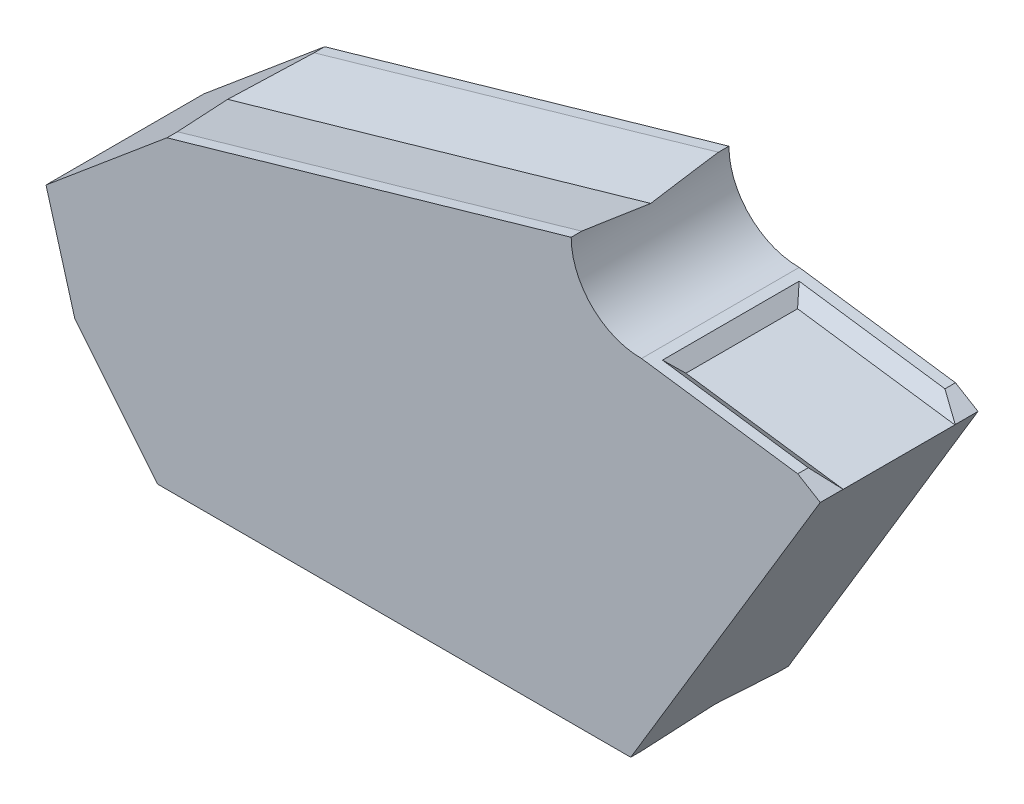
ISO-10303-21;
HEADER;
FILE_DESCRIPTION(('STEP AP214'),'2;1');
FILE_NAME('part.step','',(''),(''),'','','');
FILE_SCHEMA(('AUTOMOTIVE_DESIGN { 1 0 10303 214 1 1 1 1 }'));
ENDSEC;
DATA;
#1=APPLICATION_CONTEXT('core data for automotive mechanical design processes');
#2=APPLICATION_PROTOCOL_DEFINITION('international standard','automotive_design',2000,#1);
#3=PRODUCT_CONTEXT('',#1,'mechanical');
#4=PRODUCT('Part','Part','',(#3));
#5=PRODUCT_RELATED_PRODUCT_CATEGORY('part','',(#4));
#6=PRODUCT_DEFINITION_FORMATION('','',#4);
#7=PRODUCT_DEFINITION_CONTEXT('part definition',#1,'design');
#8=PRODUCT_DEFINITION('design','',#6,#7);
#9=PRODUCT_DEFINITION_SHAPE('','',#8);
#10=(LENGTH_UNIT() NAMED_UNIT(*) SI_UNIT(.MILLI.,.METRE.));
#11=(NAMED_UNIT(*) PLANE_ANGLE_UNIT() SI_UNIT($,.RADIAN.));
#12=(NAMED_UNIT(*) SI_UNIT($,.STERADIAN.) SOLID_ANGLE_UNIT());
#13=UNCERTAINTY_MEASURE_WITH_UNIT(LENGTH_MEASURE(1.E-05),#10,'distance_accuracy_value','');
#14=(GEOMETRIC_REPRESENTATION_CONTEXT(3) GLOBAL_UNCERTAINTY_ASSIGNED_CONTEXT((#13)) GLOBAL_UNIT_ASSIGNED_CONTEXT((#10,
#11,#12)) REPRESENTATION_CONTEXT('',''));
#15=CARTESIAN_POINT('',(0.,0.,0.));
#16=DIRECTION('',(0.,0.,1.));
#17=DIRECTION('',(1.,0.,0.));
#18=AXIS2_PLACEMENT_3D('',#15,#16,#17);
#19=CARTESIAN_POINT('',(0.,0.,3.));
#20=DIRECTION('',(0.,1.,0.));
#21=DIRECTION('',(0.,0.,1.));
#22=AXIS2_PLACEMENT_3D('',#19,#20,#21);
#23=PLANE('',#22);
#24=DIRECTION('',(0.,0.,-1.));
#25=VECTOR('',#24,1.);
#26=CARTESIAN_POINT('',(9.,0.,3.));
#27=LINE('',#26,#25);
#28=CARTESIAN_POINT('',(9.,0.,0.199999999999999));
#29=VERTEX_POINT('',#28);
#30=CARTESIAN_POINT('',(9.,0.,0.));
#31=VERTEX_POINT('',#30);
#32=EDGE_CURVE('E187',#29,#31,#27,.T.);
#33=ORIENTED_EDGE('',*,*,#32,.F.);
#34=DIRECTION('',(1.,0.,0.));
#35=VECTOR('',#34,1.);
#36=CARTESIAN_POINT('',(13.7314236186779,0.,0.2));
#37=LINE('',#36,#35);
#38=CARTESIAN_POINT('',(0.,0.,0.199999999999998));
#39=VERTEX_POINT('',#38);
#40=EDGE_CURVE('E181',#39,#29,#37,.T.);
#41=ORIENTED_EDGE('',*,*,#40,.F.);
#42=DIRECTION('',(0.,0.,-1.));
#43=VECTOR('',#42,1.);
#44=CARTESIAN_POINT('',(0.,0.,3.));
#45=LINE('',#44,#43);
#46=CARTESIAN_POINT('',(0.,0.,0.));
#47=VERTEX_POINT('',#46);
#48=EDGE_CURVE('E186',#39,#47,#45,.T.);
#49=ORIENTED_EDGE('',*,*,#48,.T.);
#50=DIRECTION('',(1.,0.,0.));
#51=VECTOR('',#50,1.);
#52=CARTESIAN_POINT('',(0.,0.,0.));
#53=LINE('',#52,#51);
#54=EDGE_CURVE('E288',#47,#31,#53,.T.);
#55=ORIENTED_EDGE('',*,*,#54,.T.);
#56=EDGE_LOOP('',(#33,#41,#49,#55));
#57=FACE_BOUND('',#56,.T.);
#58=ADVANCED_FACE('F31',(#57),#23,.F.);
#59=CARTESIAN_POINT('',(7.86830957964082,8.,3.));
#60=DIRECTION('',(0.275856954738902,-0.961198699812988,0.));
#61=DIRECTION('',(0.961198699812989,0.275856954738902,0.));
#62=AXIS2_PLACEMENT_3D('',#59,#60,#61);
#63=PLANE('',#62);
#64=DIRECTION('',(0.,0.,-1.));
#65=VECTOR('',#64,1.);
#66=CARTESIAN_POINT('',(7.86830957964082,8.,3.));
#67=LINE('',#66,#65);
#68=CARTESIAN_POINT('',(7.86830957964082,8.,3.));
#69=VERTEX_POINT('',#68);
#70=CARTESIAN_POINT('',(7.86830957964082,8.,2.8));
#71=VERTEX_POINT('',#70);
#72=EDGE_CURVE('E223',#69,#71,#67,.T.);
#73=ORIENTED_EDGE('',*,*,#72,.T.);
#74=DIRECTION('',(0.961198699812988,0.275856954738902,0.));
#75=VECTOR('',#74,1.);
#76=CARTESIAN_POINT('',(-3.4128844141553,4.76238032619805,2.8));
#77=LINE('',#76,#75);
#78=CARTESIAN_POINT('',(0.178719981136918,5.79314436208879,2.8));
#79=VERTEX_POINT('',#78);
#80=EDGE_CURVE('E214',#79,#71,#77,.T.);
#81=ORIENTED_EDGE('',*,*,#80,.F.);
#82=DIRECTION('',(0.,0.,-1.));
#83=VECTOR('',#82,1.);
#84=CARTESIAN_POINT('',(0.178719981136915,5.79314436208878,3.));
#85=LINE('',#84,#83);
#86=CARTESIAN_POINT('',(0.178719981136915,5.79314436208878,3.));
#87=VERTEX_POINT('',#86);
#88=EDGE_CURVE('E209',#87,#79,#85,.T.);
#89=ORIENTED_EDGE('',*,*,#88,.F.);
#90=DIRECTION('',(-0.961198699812989,-0.275856954738902,0.));
#91=VECTOR('',#90,1.);
#92=CARTESIAN_POINT('',(7.86830957964082,8.,3.));
#93=LINE('',#92,#91);
#94=EDGE_CURVE('E279',#69,#87,#93,.T.);
#95=ORIENTED_EDGE('',*,*,#94,.F.);
#96=EDGE_LOOP('',(#73,#81,#89,#95));
#97=FACE_BOUND('',#96,.T.);
#98=ADVANCED_FACE('F220',(#97),#63,.F.);
#99=CARTESIAN_POINT('',(12.605551275464,6.,3.));
#100=DIRECTION('',(-0.515078753637713,-0.857142857142857,0.));
#101=DIRECTION('',(0.857142857142857,-0.515078753637713,0.));
#102=AXIS2_PLACEMENT_3D('',#99,#100,#101);
#103=PLANE('',#102);
#104=DIRECTION('',(0.,0.,-1.));
#105=VECTOR('',#104,1.);
#106=CARTESIAN_POINT('',(12.1769798468926,6.25753937681886,3.));
#107=LINE('',#106,#105);
#108=CARTESIAN_POINT('',(12.1769798468926,6.25753937681886,0.2));
#109=VERTEX_POINT('',#108);
#110=CARTESIAN_POINT('',(12.1769798468926,6.25753937681886,0.));
#111=VERTEX_POINT('',#110);
#112=EDGE_CURVE('E319',#109,#111,#107,.T.);
#113=ORIENTED_EDGE('',*,*,#112,.F.);
#114=DIRECTION('',(0.776613506286922,-0.466686636355895,0.42317259516603));
#115=VECTOR('',#114,1.);
#116=CARTESIAN_POINT('',(13.4490011755885,5.49314968946937,0.893117699361664));
#117=LINE('',#116,#115);
#118=CARTESIAN_POINT('',(12.605551275464,6.,0.433526306424525));
#119=VERTEX_POINT('',#118);
#120=EDGE_CURVE('E259',#109,#119,#117,.T.);
#121=ORIENTED_EDGE('',*,*,#120,.T.);
#122=DIRECTION('',(0.,0.,-1.));
#123=VECTOR('',#122,1.);
#124=CARTESIAN_POINT('',(12.605551275464,6.,3.));
#125=LINE('',#124,#123);
#126=CARTESIAN_POINT('',(12.605551275464,6.,0.));
#127=VERTEX_POINT('',#126);
#128=EDGE_CURVE('E322',#119,#127,#125,.T.);
#129=ORIENTED_EDGE('',*,*,#128,.T.);
#130=DIRECTION('',(-0.857142857142857,0.515078753637713,0.));
#131=VECTOR('',#130,1.);
#132=CARTESIAN_POINT('',(12.605551275464,6.,0.));
#133=LINE('',#132,#131);
#134=EDGE_CURVE('E294',#127,#111,#133,.T.);
#135=ORIENTED_EDGE('',*,*,#134,.T.);
#136=EDGE_LOOP('',(#113,#121,#129,#135));
#137=FACE_BOUND('',#136,.T.);
#138=ADVANCED_FACE('F334',(#137),#103,.F.);
#139=CARTESIAN_POINT('',(-1.57391937320297,1.94236397378462,3.));
#140=DIRECTION('',(0.776945589513848,0.629567749281187,0.));
#141=DIRECTION('',(-0.629567749281187,0.776945589513848,0.));
#142=AXIS2_PLACEMENT_3D('',#139,#140,#141);
#143=PLANE('',#142);
#144=ORIENTED_EDGE('',*,*,#48,.F.);
#145=DIRECTION('',(-0.11206317795339,0.138296461273947,0.984030453261529));
#146=VECTOR('',#145,1.);
#147=CARTESIAN_POINT('',(-0.358634190385133,0.442588192909718,3.34917862731458));
#148=LINE('',#147,#146);
#149=CARTESIAN_POINT('',(-0.148046364679617,0.182703085113107,1.5));
#150=VERTEX_POINT('',#149);
#151=EDGE_CURVE('E227',#39,#150,#148,.T.);
#152=ORIENTED_EDGE('',*,*,#151,.T.);
#153=DIRECTION('',(0.11206317795339,-0.138296461273947,0.984030453261529));
#154=VECTOR('',#153,1.);
#155=CARTESIAN_POINT('',(-0.0278134509989285,0.0343244044941158,2.5557691715237));
#156=LINE('',#155,#154);
#157=CARTESIAN_POINT('',(0.,0.,2.8));
#158=VERTEX_POINT('',#157);
#159=EDGE_CURVE('E402',#150,#158,#156,.T.);
#160=ORIENTED_EDGE('',*,*,#159,.T.);
#161=CARTESIAN_POINT('',(0.,0.,3.));
#162=VERTEX_POINT('',#161);
#163=EDGE_CURVE('E180',#162,#158,#45,.T.);
#164=ORIENTED_EDGE('',*,*,#163,.F.);
#165=DIRECTION('',(0.629567749281187,-0.776945589513848,0.));
#166=VECTOR('',#165,1.);
#167=CARTESIAN_POINT('',(-1.57391937320297,1.94236397378462,3.));
#168=LINE('',#167,#166);
#169=CARTESIAN_POINT('',(-1.57391937320297,1.94236397378462,3.));
#170=VERTEX_POINT('',#169);
#171=EDGE_CURVE('E266',#170,#162,#168,.T.);
#172=ORIENTED_EDGE('',*,*,#171,.F.);
#173=DIRECTION('',(0.,0.,-1.));
#174=VECTOR('',#173,1.);
#175=CARTESIAN_POINT('',(-1.57391937320297,1.94236397378462,3.));
#176=LINE('',#175,#174);
#177=CARTESIAN_POINT('',(-1.57391937320297,1.94236397378462,0.));
#178=VERTEX_POINT('',#177);
#179=EDGE_CURVE('E285',#170,#178,#176,.T.);
#180=ORIENTED_EDGE('',*,*,#179,.T.);
#181=DIRECTION('',(0.629567749281187,-0.776945589513848,0.));
#182=VECTOR('',#181,1.);
#183=CARTESIAN_POINT('',(-1.57391937320297,1.94236397378462,0.));
#184=LINE('',#183,#182);
#185=EDGE_CURVE('E265',#178,#47,#184,.T.);
#186=ORIENTED_EDGE('',*,*,#185,.T.);
#187=EDGE_LOOP('',(#144,#152,#160,#164,#172,#180,#186));
#188=FACE_BOUND('',#187,.T.);
#189=ADVANCED_FACE('F33',(#188),#143,.F.);
#190=ORIENTED_EDGE('',*,*,#163,.T.);
#191=DIRECTION('',(-1.,0.,0.));
#192=VECTOR('',#191,1.);
#193=CARTESIAN_POINT('',(13.7314236186779,0.,2.8));
#194=LINE('',#193,#192);
#195=CARTESIAN_POINT('',(9.,0.,2.8));
#196=VERTEX_POINT('',#195);
#197=EDGE_CURVE('E168',#196,#158,#194,.T.);
#198=ORIENTED_EDGE('',*,*,#197,.F.);
#199=CARTESIAN_POINT('',(9.,0.,3.));
#200=VERTEX_POINT('',#199);
#201=EDGE_CURVE('E177',#200,#196,#27,.T.);
#202=ORIENTED_EDGE('',*,*,#201,.F.);
#203=DIRECTION('',(1.,0.,0.));
#204=VECTOR('',#203,1.);
#205=CARTESIAN_POINT('',(0.,0.,3.));
#206=LINE('',#205,#204);
#207=EDGE_CURVE('E269',#162,#200,#206,.T.);
#208=ORIENTED_EDGE('',*,*,#207,.F.);
#209=EDGE_LOOP('',(#190,#198,#202,#208));
#210=FACE_BOUND('',#209,.T.);
#211=ADVANCED_FACE('F176',(#210),#23,.F.);
#212=CARTESIAN_POINT('',(9.,0.,3.));
#213=DIRECTION('',(-0.857142857142857,0.515078753637712,0.));
#214=DIRECTION('',(-0.515078753637712,-0.857142857142857,0.));
#215=AXIS2_PLACEMENT_3D('',#212,#213,#214);
#216=PLANE('',#215);
#217=DIRECTION('',(0.0833416700029704,0.138688922113158,-0.986822957234076));
#218=VECTOR('',#217,1.);
#219=CARTESIAN_POINT('',(8.98355130534937,-0.0273722824510627,2.99476390978484));
#220=LINE('',#219,#218);
#221=CARTESIAN_POINT('',(9.10979089026013,0.182703085113108,1.5));
#222=VERTEX_POINT('',#221);
#223=EDGE_CURVE('E39',#196,#222,#220,.T.);
#224=ORIENTED_EDGE('',*,*,#223,.T.);
#225=DIRECTION('',(-0.0833416700029704,-0.138688922113158,-0.986822957234076));
#226=VECTOR('',#225,1.);
#227=CARTESIAN_POINT('',(9.23028172510884,0.383211954314876,2.92669473698778));
#228=LINE('',#227,#226);
#229=EDGE_CURVE('E11',#222,#29,#228,.T.);
#230=ORIENTED_EDGE('',*,*,#229,.T.);
#231=ORIENTED_EDGE('',*,*,#32,.T.);
#232=DIRECTION('',(0.515078753637712,0.857142857142857,0.));
#233=VECTOR('',#232,1.);
#234=CARTESIAN_POINT('',(9.,0.,0.));
#235=LINE('',#234,#233);
#236=EDGE_CURVE('E291',#31,#127,#235,.T.);
#237=ORIENTED_EDGE('',*,*,#236,.T.);
#238=ORIENTED_EDGE('',*,*,#128,.F.);
#239=DIRECTION('',(-0.347097370021527,-0.577604937780607,0.738847718799754));
#240=VECTOR('',#239,1.);
#241=CARTESIAN_POINT('',(10.3100782760546,2.18010203039364,5.31977764585383));
#242=LINE('',#241,#240);
#243=CARTESIAN_POINT('',(12.6032848534297,5.99622844575863,0.438350718518842));
#244=VERTEX_POINT('',#243);
#245=EDGE_CURVE('E262',#119,#244,#242,.T.);
#246=ORIENTED_EDGE('',*,*,#245,.T.);
#247=DIRECTION('',(0.,0.,1.));
#248=VECTOR('',#247,1.);
#249=CARTESIAN_POINT('',(12.6032848534297,5.99622844575863,3.));
#250=LINE('',#249,#248);
#251=CARTESIAN_POINT('',(12.6032848534297,5.99622844575863,2.56164928148116));
#252=VERTEX_POINT('',#251);
#253=EDGE_CURVE('E197',#244,#252,#250,.T.);
#254=ORIENTED_EDGE('',*,*,#253,.T.);
#255=DIRECTION('',(0.347097370021527,0.577604937780607,0.738847718799754));
#256=VECTOR('',#255,1.);
#257=CARTESIAN_POINT('',(11.07943457618,3.46038830233366,-0.682089791127033));
#258=LINE('',#257,#256);
#259=CARTESIAN_POINT('',(12.605551275464,6.,2.56647369357547));
#260=VERTEX_POINT('',#259);
#261=EDGE_CURVE('E256',#252,#260,#258,.T.);
#262=ORIENTED_EDGE('',*,*,#261,.T.);
#263=CARTESIAN_POINT('',(12.605551275464,6.,3.));
#264=VERTEX_POINT('',#263);
#265=EDGE_CURVE('E190',#264,#260,#125,.T.);
#266=ORIENTED_EDGE('',*,*,#265,.F.);
#267=DIRECTION('',(0.515078753637712,0.857142857142857,0.));
#268=VECTOR('',#267,1.);
#269=CARTESIAN_POINT('',(9.,0.,3.));
#270=LINE('',#269,#268);
#271=EDGE_CURVE('E185',#200,#264,#270,.T.);
#272=ORIENTED_EDGE('',*,*,#271,.F.);
#273=ORIENTED_EDGE('',*,*,#201,.T.);
#274=EDGE_LOOP('',(#224,#230,#231,#237,#238,#246,#254,#262,#266,#272,#273));
#275=FACE_BOUND('',#274,.T.);
#276=ADVANCED_FACE('F183',(#275),#216,.F.);
#277=ORIENTED_EDGE('',*,*,#265,.T.);
#278=DIRECTION('',(-0.776613506286922,0.466686636355895,0.42317259516603));
#279=VECTOR('',#278,1.);
#280=CARTESIAN_POINT('',(12.4630765168992,6.08561667457746,2.64410743653699));
#281=LINE('',#280,#279);
#282=CARTESIAN_POINT('',(12.1769798468926,6.25753937681886,2.8));
#283=VERTEX_POINT('',#282);
#284=EDGE_CURVE('E243',#260,#283,#281,.T.);
#285=ORIENTED_EDGE('',*,*,#284,.T.);
#286=CARTESIAN_POINT('',(12.1769798468926,6.25753937681886,3.));
#287=VERTEX_POINT('',#286);
#288=EDGE_CURVE('E320',#287,#283,#107,.T.);
#289=ORIENTED_EDGE('',*,*,#288,.F.);
#290=DIRECTION('',(-0.857142857142857,0.515078753637713,0.));
#291=VECTOR('',#290,1.);
#292=CARTESIAN_POINT('',(12.605551275464,6.,3.));
#293=LINE('',#292,#291);
#294=EDGE_CURVE('E273',#264,#287,#293,.T.);
#295=ORIENTED_EDGE('',*,*,#294,.F.);
#296=EDGE_LOOP('',(#277,#285,#289,#295));
#297=FACE_BOUND('',#296,.T.);
#298=ADVANCED_FACE('F352',(#297),#103,.F.);
#299=CARTESIAN_POINT('',(12.1769798468926,6.25753937681886,3.));
#300=DIRECTION('',(-0.137958239333101,-0.990438046623872,0.));
#301=DIRECTION('',(0.990438046623872,-0.137958239333101,0.));
#302=AXIS2_PLACEMENT_3D('',#299,#300,#301);
#303=PLANE('',#302);
#304=DIRECTION('',(0.,0.,1.));
#305=VECTOR('',#304,1.);
#306=CARTESIAN_POINT('',(9.40375331634572,6.64382244695154,0.2));
#307=LINE('',#306,#305);
#308=CARTESIAN_POINT('',(9.40375331634572,6.64382244695154,0.2));
#309=VERTEX_POINT('',#308);
#310=CARTESIAN_POINT('',(9.40375331634572,6.64382244695154,2.8));
#311=VERTEX_POINT('',#310);
#312=EDGE_CURVE('E235',#309,#311,#307,.T.);
#313=ORIENTED_EDGE('',*,*,#312,.F.);
#314=DIRECTION('',(0.990438046623872,-0.137958239333101,0.));
#315=VECTOR('',#314,1.);
#316=CARTESIAN_POINT('',(12.1769798468926,6.25753937681886,0.200000000000001));
#317=LINE('',#316,#315);
#318=EDGE_CURVE('E194',#309,#109,#317,.T.);
#319=ORIENTED_EDGE('',*,*,#318,.T.);
#320=ORIENTED_EDGE('',*,*,#112,.T.);
#321=DIRECTION('',(-0.990438046623872,0.137958239333101,0.));
#322=VECTOR('',#321,1.);
#323=CARTESIAN_POINT('',(12.1769798468926,6.25753937681886,0.));
#324=LINE('',#323,#322);
#325=CARTESIAN_POINT('',(9.20566570702094,6.67141409481816,0.));
#326=VERTEX_POINT('',#325);
#327=EDGE_CURVE('E297',#111,#326,#324,.T.);
#328=ORIENTED_EDGE('',*,*,#327,.T.);
#329=DIRECTION('',(0.,0.,-1.));
#330=VECTOR('',#329,1.);
#331=CARTESIAN_POINT('',(9.20566570702094,6.67141409481816,3.));
#332=LINE('',#331,#330);
#333=CARTESIAN_POINT('',(9.20566570702094,6.67141409481816,3.));
#334=VERTEX_POINT('',#333);
#335=EDGE_CURVE('E317',#334,#326,#332,.T.);
#336=ORIENTED_EDGE('',*,*,#335,.F.);
#337=DIRECTION('',(-0.990438046623872,0.137958239333101,0.));
#338=VECTOR('',#337,1.);
#339=CARTESIAN_POINT('',(12.1769798468926,6.25753937681886,3.));
#340=LINE('',#339,#338);
#341=EDGE_CURVE('E275',#287,#334,#340,.T.);
#342=ORIENTED_EDGE('',*,*,#341,.F.);
#343=ORIENTED_EDGE('',*,*,#288,.T.);
#344=DIRECTION('',(0.990438046623872,-0.137958239333101,0.));
#345=VECTOR('',#344,1.);
#346=CARTESIAN_POINT('',(13.720529677425,6.04253812795828,2.8));
#347=LINE('',#346,#345);
#348=EDGE_CURVE('E237',#311,#283,#347,.T.);
#349=ORIENTED_EDGE('',*,*,#348,.F.);
#350=EDGE_LOOP('',(#313,#319,#320,#328,#336,#342,#343,#349));
#351=FACE_BOUND('',#350,.T.);
#352=ADVANCED_FACE('F329',(#351),#303,.F.);
#353=CARTESIAN_POINT('',(9.19692424185896,8.,3.));
#354=DIRECTION('',(0.,0.,-1.));
#355=DIRECTION('',(-1.,0.,0.));
#356=AXIS2_PLACEMENT_3D('',#353,#354,#355);
#357=CYLINDRICAL_SURFACE('',#356,1.32861466221814);
#358=CARTESIAN_POINT('',(9.19692424185896,8.,2.80783704264364));
#359=DIRECTION('',(0.273172333818223,-0.951844380140717,-0.139173100960065));
#360=DIRECTION('',(-0.0383918678124133,0.133773003691756,-0.99026806874157));
#361=AXIS2_PLACEMENT_3D('',#358,#359,#360);
#362=ELLIPSE('',#361,9.54649032789304,1.32861466221814);
#363=CARTESIAN_POINT('',(7.86830957964082,8.,0.2));
#364=VERTEX_POINT('',#363);
#365=CARTESIAN_POINT('',(7.88143755309194,7.8136892586623,1.5));
#366=VERTEX_POINT('',#365);
#367=EDGE_CURVE('E225',#364,#366,#362,.F.);
#368=ORIENTED_EDGE('',*,*,#367,.T.);
#369=CARTESIAN_POINT('',(9.19692424185896,8.,0.192162957356357));
#370=DIRECTION('',(0.273172333818223,-0.951844380140717,0.139173100960065));
#371=DIRECTION('',(0.0383918678124133,-0.133773003691756,-0.99026806874157));
#372=AXIS2_PLACEMENT_3D('',#369,#370,#371);
#373=ELLIPSE('',#372,9.54649032789304,1.32861466221814);
#374=EDGE_CURVE('E233',#366,#71,#373,.F.);
#375=ORIENTED_EDGE('',*,*,#374,.T.);
#376=ORIENTED_EDGE('',*,*,#72,.F.);
#377=CARTESIAN_POINT('',(9.19692424185896,8.,3.));
#378=DIRECTION('',(0.,0.,-1.));
#379=DIRECTION('',(1.,0.,0.));
#380=AXIS2_PLACEMENT_3D('',#377,#378,#379);
#381=CIRCLE('',#380,1.32861466221814);
#382=EDGE_CURVE('E277',#334,#69,#381,.T.);
#383=ORIENTED_EDGE('',*,*,#382,.F.);
#384=ORIENTED_EDGE('',*,*,#335,.T.);
#385=CARTESIAN_POINT('',(9.19692424185896,8.,0.));
#386=DIRECTION('',(0.,0.,-1.));
#387=DIRECTION('',(1.,0.,0.));
#388=AXIS2_PLACEMENT_3D('',#385,#386,#387);
#389=CIRCLE('',#388,1.32861466221814);
#390=CARTESIAN_POINT('',(7.86830957964082,8.,0.));
#391=VERTEX_POINT('',#390);
#392=EDGE_CURVE('E299',#326,#391,#389,.T.);
#393=ORIENTED_EDGE('',*,*,#392,.T.);
#394=EDGE_CURVE('E315',#364,#391,#67,.T.);
#395=ORIENTED_EDGE('',*,*,#394,.F.);
#396=EDGE_LOOP('',(#368,#375,#376,#383,#384,#393,#395));
#397=FACE_BOUND('',#396,.T.);
#398=ADVANCED_FACE('F345',(#397),#357,.F.);
#399=CARTESIAN_POINT('',(0.178719981136915,5.79314436208878,0.2));
#400=VERTEX_POINT('',#399);
#401=CARTESIAN_POINT('',(0.178719981136915,5.79314436208878,0.));
#402=VERTEX_POINT('',#401);
#403=EDGE_CURVE('E313',#400,#402,#85,.T.);
#404=ORIENTED_EDGE('',*,*,#403,.F.);
#405=DIRECTION('',(-0.961198699812988,-0.275856954738902,0.));
#406=VECTOR('',#405,1.);
#407=CARTESIAN_POINT('',(-3.4128844141553,4.76238032619805,0.2));
#408=LINE('',#407,#406);
#409=EDGE_CURVE('E54',#364,#400,#408,.T.);
#410=ORIENTED_EDGE('',*,*,#409,.F.);
#411=ORIENTED_EDGE('',*,*,#394,.T.);
#412=DIRECTION('',(-0.961198699812989,-0.275856954738902,0.));
#413=VECTOR('',#412,1.);
#414=CARTESIAN_POINT('',(7.86830957964082,8.,0.));
#415=LINE('',#414,#413);
#416=EDGE_CURVE('E302',#391,#402,#415,.T.);
#417=ORIENTED_EDGE('',*,*,#416,.T.);
#418=EDGE_LOOP('',(#404,#410,#411,#417));
#419=FACE_BOUND('',#418,.T.);
#420=ADVANCED_FACE('F381',(#419),#63,.F.);
#421=CARTESIAN_POINT('',(0.178719981136915,5.79314436208878,3.));
#422=DIRECTION('',(0.64231533775632,-0.766440478369315,0.));
#423=DIRECTION('',(0.766440478369316,0.64231533775632,0.));
#424=AXIS2_PLACEMENT_3D('',#421,#422,#423);
#425=PLANE('',#424);
#426=ORIENTED_EDGE('',*,*,#88,.T.);
#427=DIRECTION('',(-0.250734007877706,-0.210127600905965,-0.944975580970792));
#428=VECTOR('',#427,1.);
#429=CARTESIAN_POINT('',(0.226107484089591,5.83285745243761,2.97859576972622));
#430=LINE('',#429,#428);
#431=CARTESIAN_POINT('',(-0.166214022243528,5.5040724678742,1.5));
#432=VERTEX_POINT('',#431);
#433=EDGE_CURVE('E172',#79,#432,#430,.T.);
#434=ORIENTED_EDGE('',*,*,#433,.T.);
#435=DIRECTION('',(0.250734007877706,0.210127600905965,-0.944975580970792));
#436=VECTOR('',#435,1.);
#437=CARTESIAN_POINT('',(-0.484705060200519,5.23716109720527,2.70034077616704));
#438=LINE('',#437,#436);
#439=EDGE_CURVE('E200',#432,#400,#438,.T.);
#440=ORIENTED_EDGE('',*,*,#439,.T.);
#441=ORIENTED_EDGE('',*,*,#403,.T.);
#442=DIRECTION('',(-0.766440478369315,-0.64231533775632,0.));
#443=VECTOR('',#442,1.);
#444=CARTESIAN_POINT('',(0.178719981136915,5.79314436208878,0.));
#445=LINE('',#444,#443);
#446=CARTESIAN_POINT('',(-2.12060145397103,3.86619834881983,0.));
#447=VERTEX_POINT('',#446);
#448=EDGE_CURVE('E305',#402,#447,#445,.T.);
#449=ORIENTED_EDGE('',*,*,#448,.T.);
#450=DIRECTION('',(0.,0.,-1.));
#451=VECTOR('',#450,1.);
#452=CARTESIAN_POINT('',(-2.12060145397103,3.86619834881983,3.));
#453=LINE('',#452,#451);
#454=CARTESIAN_POINT('',(-2.12060145397103,3.86619834881983,3.));
#455=VERTEX_POINT('',#454);
#456=EDGE_CURVE('E310',#455,#447,#453,.T.);
#457=ORIENTED_EDGE('',*,*,#456,.F.);
#458=DIRECTION('',(-0.766440478369315,-0.64231533775632,0.));
#459=VECTOR('',#458,1.);
#460=CARTESIAN_POINT('',(0.178719981136915,5.79314436208878,3.));
#461=LINE('',#460,#459);
#462=EDGE_CURVE('E281',#87,#455,#461,.T.);
#463=ORIENTED_EDGE('',*,*,#462,.F.);
#464=EDGE_LOOP('',(#426,#434,#440,#441,#449,#457,#463));
#465=FACE_BOUND('',#464,.T.);
#466=ADVANCED_FACE('F205',(#465),#425,.F.);
#467=CARTESIAN_POINT('',(-2.12060145397103,3.86619834881983,3.));
#468=DIRECTION('',(0.961917187517603,0.273341040384031,0.));
#469=DIRECTION('',(-0.273341040384031,0.961917187517603,0.));
#470=AXIS2_PLACEMENT_3D('',#467,#468,#469);
#471=PLANE('',#470);
#472=DIRECTION('',(0.273341040384031,-0.961917187517603,0.));
#473=VECTOR('',#472,1.);
#474=CARTESIAN_POINT('',(-2.12060145397103,3.86619834881983,0.));
#475=LINE('',#474,#473);
#476=EDGE_CURVE('E270',#447,#178,#475,.T.);
#477=ORIENTED_EDGE('',*,*,#476,.T.);
#478=ORIENTED_EDGE('',*,*,#179,.F.);
#479=DIRECTION('',(0.273341040384031,-0.961917187517603,0.));
#480=VECTOR('',#479,1.);
#481=CARTESIAN_POINT('',(-2.12060145397103,3.86619834881983,3.));
#482=LINE('',#481,#480);
#483=EDGE_CURVE('E283',#455,#170,#482,.T.);
#484=ORIENTED_EDGE('',*,*,#483,.F.);
#485=ORIENTED_EDGE('',*,*,#456,.T.);
#486=EDGE_LOOP('',(#477,#478,#484,#485));
#487=FACE_BOUND('',#486,.T.);
#488=ADVANCED_FACE('F410',(#487),#471,.F.);
#489=CARTESIAN_POINT('',(9.19692424185896,8.,3.));
#490=DIRECTION('',(0.,0.,1.));
#491=DIRECTION('',(1.,0.,0.));
#492=AXIS2_PLACEMENT_3D('',#489,#490,#491);
#493=PLANE('',#492);
#494=ORIENTED_EDGE('',*,*,#171,.T.);
#495=ORIENTED_EDGE('',*,*,#207,.T.);
#496=ORIENTED_EDGE('',*,*,#271,.T.);
#497=ORIENTED_EDGE('',*,*,#294,.T.);
#498=ORIENTED_EDGE('',*,*,#341,.T.);
#499=ORIENTED_EDGE('',*,*,#382,.T.);
#500=ORIENTED_EDGE('',*,*,#94,.T.);
#501=ORIENTED_EDGE('',*,*,#462,.T.);
#502=ORIENTED_EDGE('',*,*,#483,.T.);
#503=EDGE_LOOP('',(#494,#495,#496,#497,#498,#499,#500,#501,#502));
#504=FACE_BOUND('',#503,.T.);
#505=ADVANCED_FACE('F348',(#504),#493,.T.);
#506=CARTESIAN_POINT('',(9.19692424185896,8.,0.));
#507=DIRECTION('',(0.,0.,1.));
#508=DIRECTION('',(1.,0.,0.));
#509=AXIS2_PLACEMENT_3D('',#506,#507,#508);
#510=PLANE('',#509);
#511=ORIENTED_EDGE('',*,*,#185,.F.);
#512=ORIENTED_EDGE('',*,*,#476,.F.);
#513=ORIENTED_EDGE('',*,*,#448,.F.);
#514=ORIENTED_EDGE('',*,*,#416,.F.);
#515=ORIENTED_EDGE('',*,*,#392,.F.);
#516=ORIENTED_EDGE('',*,*,#327,.F.);
#517=ORIENTED_EDGE('',*,*,#134,.F.);
#518=ORIENTED_EDGE('',*,*,#236,.F.);
#519=ORIENTED_EDGE('',*,*,#54,.F.);
#520=EDGE_LOOP('',(#511,#512,#513,#514,#515,#516,#517,#518,#519));
#521=FACE_BOUND('',#520,.T.);
#522=ADVANCED_FACE('F340',(#521),#510,.F.);
#523=CARTESIAN_POINT('',(9.3761616684791,6.44573483762677,2.8));
#524=DIRECTION('',(-0.137958239333101,-0.990438046623872,0.));
#525=DIRECTION('',(0.990438046623872,-0.137958239333101,0.));
#526=AXIS2_PLACEMENT_3D('',#523,#524,#525);
#527=PLANE('',#526);
#528=DIRECTION('',(-0.990438046623872,0.137958239333101,0.));
#529=VECTOR('',#528,1.);
#530=CARTESIAN_POINT('',(13.6929380295584,5.84445051863351,0.438350718518842));
#531=LINE('',#530,#529);
#532=CARTESIAN_POINT('',(9.6122332885403,6.41285239215613,0.438350718518842));
#533=VERTEX_POINT('',#532);
#534=EDGE_CURVE('E247',#244,#533,#531,.T.);
#535=ORIENTED_EDGE('',*,*,#534,.T.);
#536=DIRECTION('',(0.,0.,1.));
#537=VECTOR('',#536,1.);
#538=CARTESIAN_POINT('',(9.6122332885403,6.41285239215613,0.2));
#539=LINE('',#538,#537);
#540=CARTESIAN_POINT('',(9.6122332885403,6.41285239215613,2.56164928148116));
#541=VERTEX_POINT('',#540);
#542=EDGE_CURVE('E239',#533,#541,#539,.T.);
#543=ORIENTED_EDGE('',*,*,#542,.T.);
#544=DIRECTION('',(0.990438046623872,-0.137958239333101,0.));
#545=VECTOR('',#544,1.);
#546=CARTESIAN_POINT('',(13.6929380295584,5.84445051863351,2.56164928148116));
#547=LINE('',#546,#545);
#548=EDGE_CURVE('E250',#541,#252,#547,.T.);
#549=ORIENTED_EDGE('',*,*,#548,.T.);
#550=ORIENTED_EDGE('',*,*,#253,.F.);
#551=EDGE_LOOP('',(#535,#543,#549,#550));
#552=FACE_BOUND('',#551,.T.);
#553=ADVANCED_FACE('F358',(#552),#527,.F.);
#554=CARTESIAN_POINT('',(13.720529677425,6.04253812795828,0.2));
#555=DIRECTION('',(-0.1056821426236,-0.758719561869833,-0.642787609686539));
#556=DIRECTION('',(0.,0.646407516241885,-0.762992347894786));
#557=AXIS2_PLACEMENT_3D('',#554,#555,#556);
#558=PLANE('',#557);
#559=ORIENTED_EDGE('',*,*,#120,.F.);
#560=ORIENTED_EDGE('',*,*,#318,.F.);
#561=DIRECTION('',(-0.531909135300761,0.58928961297028,-0.608120402411343));
#562=VECTOR('',#561,1.);
#563=CARTESIAN_POINT('',(10.8135590036782,5.08193190453457,1.81180086034366));
#564=LINE('',#563,#562);
#565=EDGE_CURVE('E240',#533,#309,#564,.T.);
#566=ORIENTED_EDGE('',*,*,#565,.F.);
#567=ORIENTED_EDGE('',*,*,#534,.F.);
#568=ORIENTED_EDGE('',*,*,#245,.F.);
#569=EDGE_LOOP('',(#559,#560,#566,#567,#568));
#570=FACE_BOUND('',#569,.T.);
#571=ADVANCED_FACE('F361',(#570),#558,.F.);
#572=CARTESIAN_POINT('',(13.720529677425,6.04253812795828,2.8));
#573=DIRECTION('',(-0.1056821426236,-0.758719561869833,0.642787609686539));
#574=DIRECTION('',(0.,-0.646407516241885,-0.762992347894786));
#575=AXIS2_PLACEMENT_3D('',#572,#573,#574);
#576=PLANE('',#575);
#577=ORIENTED_EDGE('',*,*,#548,.F.);
#578=DIRECTION('',(-0.531909135300761,0.58928961297028,0.608120402411343));
#579=VECTOR('',#578,1.);
#580=CARTESIAN_POINT('',(10.2447617895997,5.71208895185313,1.83849289804477));
#581=LINE('',#580,#579);
#582=EDGE_CURVE('E244',#541,#311,#581,.T.);
#583=ORIENTED_EDGE('',*,*,#582,.T.);
#584=ORIENTED_EDGE('',*,*,#348,.T.);
#585=ORIENTED_EDGE('',*,*,#284,.F.);
#586=ORIENTED_EDGE('',*,*,#261,.F.);
#587=EDGE_LOOP('',(#577,#583,#584,#585,#586));
#588=FACE_BOUND('',#587,.T.);
#589=ADVANCED_FACE('F355',(#588),#576,.F.);
#590=CARTESIAN_POINT('',(9.40375331634572,6.64382244695154,0.2));
#591=DIRECTION('',(-0.742323447155564,-0.670041714972345,0.));
#592=DIRECTION('',(0.670041714972345,-0.742323447155564,0.));
#593=AXIS2_PLACEMENT_3D('',#590,#591,#592);
#594=PLANE('',#593);
#595=ORIENTED_EDGE('',*,*,#312,.T.);
#596=ORIENTED_EDGE('',*,*,#582,.F.);
#597=ORIENTED_EDGE('',*,*,#542,.F.);
#598=ORIENTED_EDGE('',*,*,#565,.T.);
#599=EDGE_LOOP('',(#595,#596,#597,#598));
#600=FACE_BOUND('',#599,.T.);
#601=ADVANCED_FACE('F364',(#600),#594,.F.);
#602=CARTESIAN_POINT('',(-3.4128844141553,4.76238032619805,2.8));
#603=DIRECTION('',(0.273172333818223,-0.951844380140717,0.139173100960065));
#604=DIRECTION('',(0.961198699812988,0.275856954738902,0.));
#605=AXIS2_PLACEMENT_3D('',#602,#603,#604);
#606=PLANE('',#605);
#607=DIRECTION('',(0.961198699812988,0.275856954738902,0.));
#608=VECTOR('',#607,1.);
#609=CARTESIAN_POINT('',(-3.36248449747459,4.58676635833551,1.5));
#610=LINE('',#609,#608);
#611=EDGE_CURVE('E217',#432,#366,#610,.T.);
#612=ORIENTED_EDGE('',*,*,#611,.F.);
#613=ORIENTED_EDGE('',*,*,#433,.F.);
#614=ORIENTED_EDGE('',*,*,#80,.T.);
#615=ORIENTED_EDGE('',*,*,#374,.F.);
#616=EDGE_LOOP('',(#612,#613,#614,#615));
#617=FACE_BOUND('',#616,.T.);
#618=ADVANCED_FACE('F213',(#617),#606,.F.);
#619=CARTESIAN_POINT('',(-3.4128844141553,4.76238032619805,0.2));
#620=DIRECTION('',(0.273172333818223,-0.951844380140717,-0.139173100960065));
#621=DIRECTION('',(0.961198699812988,0.275856954738902,0.));
#622=AXIS2_PLACEMENT_3D('',#619,#620,#621);
#623=PLANE('',#622);
#624=ORIENTED_EDGE('',*,*,#409,.T.);
#625=ORIENTED_EDGE('',*,*,#439,.F.);
#626=ORIENTED_EDGE('',*,*,#611,.T.);
#627=ORIENTED_EDGE('',*,*,#367,.F.);
#628=EDGE_LOOP('',(#624,#625,#626,#627));
#629=FACE_BOUND('',#628,.T.);
#630=ADVANCED_FACE('F371',(#629),#623,.F.);
#631=CARTESIAN_POINT('',(13.7314236186779,0.,0.2));
#632=DIRECTION('',(0.,0.99026806874157,-0.139173100960064));
#633=DIRECTION('',(0.,0.139173100960064,0.99026806874157));
#634=AXIS2_PLACEMENT_3D('',#631,#632,#633);
#635=PLANE('',#634);
#636=ORIENTED_EDGE('',*,*,#40,.T.);
#637=ORIENTED_EDGE('',*,*,#229,.F.);
#638=DIRECTION('',(1.,0.,0.));
#639=VECTOR('',#638,1.);
#640=CARTESIAN_POINT('',(13.7314236186779,0.182703085113107,1.5));
#641=LINE('',#640,#639);
#642=EDGE_CURVE('E46',#150,#222,#641,.T.);
#643=ORIENTED_EDGE('',*,*,#642,.F.);
#644=ORIENTED_EDGE('',*,*,#151,.F.);
#645=EDGE_LOOP('',(#636,#637,#643,#644));
#646=FACE_BOUND('',#645,.T.);
#647=ADVANCED_FACE('F400',(#646),#635,.F.);
#648=CARTESIAN_POINT('',(13.7314236186779,0.,2.8));
#649=DIRECTION('',(0.,0.99026806874157,0.139173100960064));
#650=DIRECTION('',(0.,-0.139173100960064,0.99026806874157));
#651=AXIS2_PLACEMENT_3D('',#648,#649,#650);
#652=PLANE('',#651);
#653=ORIENTED_EDGE('',*,*,#642,.T.);
#654=ORIENTED_EDGE('',*,*,#223,.F.);
#655=ORIENTED_EDGE('',*,*,#197,.T.);
#656=ORIENTED_EDGE('',*,*,#159,.F.);
#657=EDGE_LOOP('',(#653,#654,#655,#656));
#658=FACE_BOUND('',#657,.T.);
#659=ADVANCED_FACE('F167',(#658),#652,.F.);
#660=CLOSED_SHELL('',(#58,#98,#138,#189,#211,#276,#298,#352,#398,#420,#466,#488,#505,#522,#553,
#571,#589,#601,#618,#630,#647,#659));
#661=MANIFOLD_SOLID_BREP('B2',#660);
#662=ADVANCED_BREP_SHAPE_REPRESENTATION('',(#18,#661),#14);
#663=SHAPE_DEFINITION_REPRESENTATION(#9,#662);
ENDSEC;
END-ISO-10303-21;
